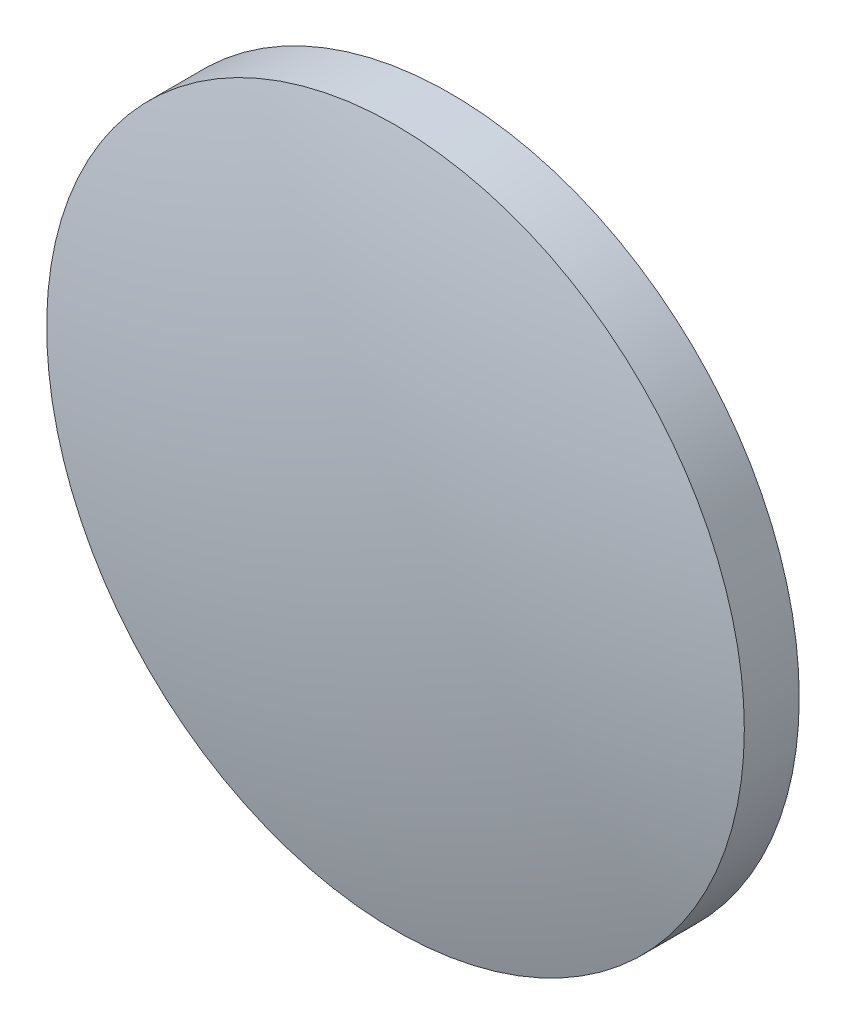
ISO-10303-21;
HEADER;
FILE_DESCRIPTION(('STEP AP214'),'2;1');
FILE_NAME('part.step','',(''),(''),'','','');
FILE_SCHEMA(('AUTOMOTIVE_DESIGN { 1 0 10303 214 1 1 1 1 }'));
ENDSEC;
DATA;
#1=APPLICATION_CONTEXT('core data for automotive mechanical design processes');
#2=APPLICATION_PROTOCOL_DEFINITION('international standard','automotive_design',2000,#1);
#3=PRODUCT_CONTEXT('',#1,'mechanical');
#4=PRODUCT('Part','Part','',(#3));
#5=PRODUCT_RELATED_PRODUCT_CATEGORY('part','',(#4));
#6=PRODUCT_DEFINITION_FORMATION('','',#4);
#7=PRODUCT_DEFINITION_CONTEXT('part definition',#1,'design');
#8=PRODUCT_DEFINITION('design','',#6,#7);
#9=PRODUCT_DEFINITION_SHAPE('','',#8);
#10=(LENGTH_UNIT() NAMED_UNIT(*) SI_UNIT(.MILLI.,.METRE.));
#11=(NAMED_UNIT(*) PLANE_ANGLE_UNIT() SI_UNIT($,.RADIAN.));
#12=(NAMED_UNIT(*) SI_UNIT($,.STERADIAN.) SOLID_ANGLE_UNIT());
#13=UNCERTAINTY_MEASURE_WITH_UNIT(LENGTH_MEASURE(1.E-05),#10,'distance_accuracy_value','');
#14=(GEOMETRIC_REPRESENTATION_CONTEXT(3) GLOBAL_UNCERTAINTY_ASSIGNED_CONTEXT((#13)) GLOBAL_UNIT_ASSIGNED_CONTEXT((#10,
#11,#12)) REPRESENTATION_CONTEXT('',''));
#15=CARTESIAN_POINT('',(0.,0.,0.));
#16=DIRECTION('',(0.,0.,1.));
#17=DIRECTION('',(1.,0.,0.));
#18=AXIS2_PLACEMENT_3D('',#15,#16,#17);
#19=CARTESIAN_POINT('',(0.,0.,-49.705));
#20=DIRECTION('',(0.,0.,1.));
#21=DIRECTION('',(0.,1.,0.));
#22=AXIS2_PLACEMENT_3D('',#19,#20,#21);
#23=SPHERICAL_SURFACE('',#22,51.5);
#24=CARTESIAN_POINT('',(0.,0.,0.204518130312582));
#25=DIRECTION('',(0.,0.,1.));
#26=DIRECTION('',(1.,0.,0.));
#27=AXIS2_PLACEMENT_3D('',#24,#25,#26);
#28=CIRCLE('',#27,12.7);
#29=CARTESIAN_POINT('',(12.7,0.,0.204518130312582));
#30=VERTEX_POINT('',#29);
#31=EDGE_CURVE('E8',#30,#30,#28,.T.);
#32=ORIENTED_EDGE('',*,*,#31,.T.);
#33=EDGE_LOOP('',(#32));
#34=FACE_BOUND('',#33,.T.);
#35=ADVANCED_FACE('F12',(#34),#23,.T.);
#36=CARTESIAN_POINT('',(0.,0.,4.30813204540037));
#37=DIRECTION('',(0.,0.,1.));
#38=DIRECTION('',(1.,0.,0.));
#39=AXIS2_PLACEMENT_3D('',#36,#37,#38);
#40=CYLINDRICAL_SURFACE('',#39,12.7);
#41=ORIENTED_EDGE('',*,*,#31,.F.);
#42=EDGE_LOOP('',(#41));
#43=FACE_BOUND('',#42,.T.);
#44=CARTESIAN_POINT('',(0.,0.,-1.795));
#45=DIRECTION('',(0.,0.,1.));
#46=DIRECTION('',(1.,0.,0.));
#47=AXIS2_PLACEMENT_3D('',#44,#45,#46);
#48=CIRCLE('',#47,12.7);
#49=CARTESIAN_POINT('',(12.7,0.,-1.795));
#50=VERTEX_POINT('',#49);
#51=EDGE_CURVE('E18',#50,#50,#48,.T.);
#52=ORIENTED_EDGE('',*,*,#51,.T.);
#53=EDGE_LOOP('',(#52));
#54=FACE_BOUND('',#53,.T.);
#55=ADVANCED_FACE('F24',(#43,#54),#40,.T.);
#56=CARTESIAN_POINT('',(0.,0.,-1.795));
#57=DIRECTION('',(0.,0.,1.));
#58=DIRECTION('',(1.,0.,0.));
#59=AXIS2_PLACEMENT_3D('',#56,#57,#58);
#60=PLANE('',#59);
#61=ORIENTED_EDGE('',*,*,#51,.F.);
#62=EDGE_LOOP('',(#61));
#63=FACE_BOUND('',#62,.T.);
#64=ADVANCED_FACE('F26',(#63),#60,.F.);
#65=CLOSED_SHELL('',(#35,#55,#64));
#66=MANIFOLD_SOLID_BREP('B1',#65);
#67=ADVANCED_BREP_SHAPE_REPRESENTATION('',(#18,#66),#14);
#68=SHAPE_DEFINITION_REPRESENTATION(#9,#67);
ENDSEC;
END-ISO-10303-21;
